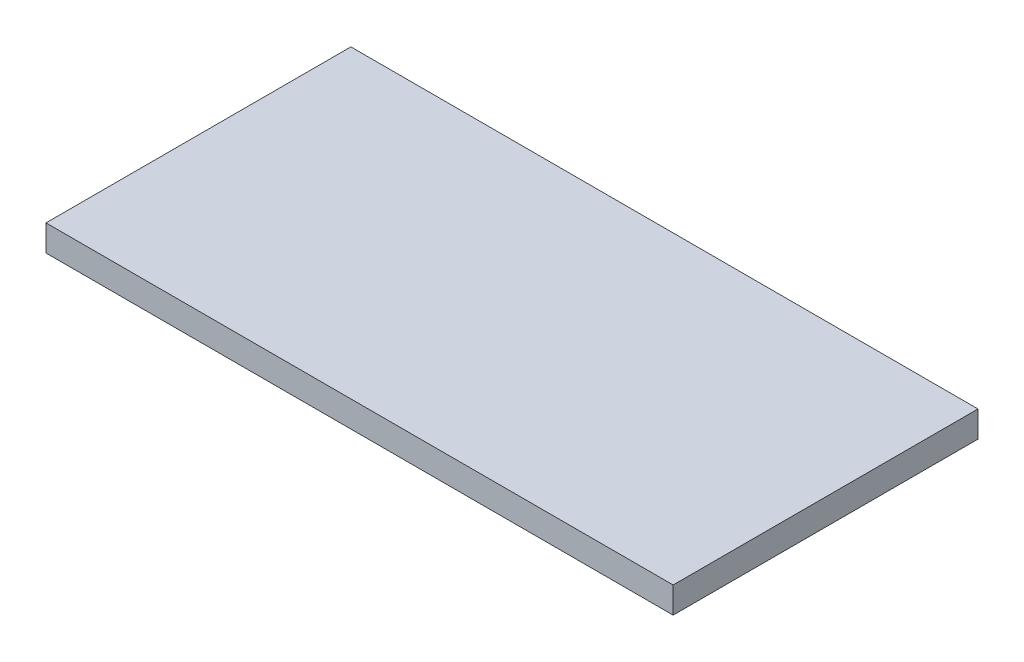
ISO-10303-21;
HEADER;
FILE_DESCRIPTION(('STEP AP214'),'2;1');
FILE_NAME('part.step','',(''),(''),'','','');
FILE_SCHEMA(('AUTOMOTIVE_DESIGN { 1 0 10303 214 1 1 1 1 }'));
ENDSEC;
DATA;
#1=APPLICATION_CONTEXT('core data for automotive mechanical design processes');
#2=APPLICATION_PROTOCOL_DEFINITION('international standard','automotive_design',2000,#1);
#3=PRODUCT_CONTEXT('',#1,'mechanical');
#4=PRODUCT('Part','Part','',(#3));
#5=PRODUCT_RELATED_PRODUCT_CATEGORY('part','',(#4));
#6=PRODUCT_DEFINITION_FORMATION('','',#4);
#7=PRODUCT_DEFINITION_CONTEXT('part definition',#1,'design');
#8=PRODUCT_DEFINITION('design','',#6,#7);
#9=PRODUCT_DEFINITION_SHAPE('','',#8);
#10=(LENGTH_UNIT() NAMED_UNIT(*) SI_UNIT(.MILLI.,.METRE.));
#11=(NAMED_UNIT(*) PLANE_ANGLE_UNIT() SI_UNIT($,.RADIAN.));
#12=(NAMED_UNIT(*) SI_UNIT($,.STERADIAN.) SOLID_ANGLE_UNIT());
#13=UNCERTAINTY_MEASURE_WITH_UNIT(LENGTH_MEASURE(1.E-05),#10,'distance_accuracy_value','');
#14=(GEOMETRIC_REPRESENTATION_CONTEXT(3) GLOBAL_UNCERTAINTY_ASSIGNED_CONTEXT((#13)) GLOBAL_UNIT_ASSIGNED_CONTEXT((#10,
#11,#12)) REPRESENTATION_CONTEXT('',''));
#15=CARTESIAN_POINT('',(0.,0.,0.));
#16=DIRECTION('',(0.,0.,1.));
#17=DIRECTION('',(1.,0.,0.));
#18=AXIS2_PLACEMENT_3D('',#15,#16,#17);
#19=CARTESIAN_POINT('',(0.,30.,0.));
#20=DIRECTION('',(1.,0.,0.));
#21=DIRECTION('',(0.,0.,-1.));
#22=AXIS2_PLACEMENT_3D('',#19,#20,#21);
#23=PLANE('',#22);
#24=DIRECTION('',(0.,0.,1.));
#25=VECTOR('',#24,1.);
#26=CARTESIAN_POINT('',(0.,0.,0.));
#27=LINE('',#26,#25);
#28=CARTESIAN_POINT('',(0.,0.,-350.));
#29=VERTEX_POINT('',#28);
#30=CARTESIAN_POINT('',(0.,0.,0.));
#31=VERTEX_POINT('',#30);
#32=EDGE_CURVE('E94',#29,#31,#27,.T.);
#33=ORIENTED_EDGE('',*,*,#32,.T.);
#34=DIRECTION('',(0.,-1.,0.));
#35=VECTOR('',#34,1.);
#36=CARTESIAN_POINT('',(0.,30.,0.));
#37=LINE('',#36,#35);
#38=CARTESIAN_POINT('',(0.,30.,0.));
#39=VERTEX_POINT('',#38);
#40=EDGE_CURVE('E11',#39,#31,#37,.T.);
#41=ORIENTED_EDGE('',*,*,#40,.F.);
#42=DIRECTION('',(0.,0.,1.));
#43=VECTOR('',#42,1.);
#44=CARTESIAN_POINT('',(0.,30.,0.));
#45=LINE('',#44,#43);
#46=CARTESIAN_POINT('',(0.,30.,-350.));
#47=VERTEX_POINT('',#46);
#48=EDGE_CURVE('E82',#47,#39,#45,.T.);
#49=ORIENTED_EDGE('',*,*,#48,.F.);
#50=DIRECTION('',(0.,-1.,0.));
#51=VECTOR('',#50,1.);
#52=CARTESIAN_POINT('',(0.,30.,-350.));
#53=LINE('',#52,#51);
#54=EDGE_CURVE('E90',#47,#29,#53,.T.);
#55=ORIENTED_EDGE('',*,*,#54,.T.);
#56=EDGE_LOOP('',(#33,#41,#49,#55));
#57=FACE_BOUND('',#56,.T.);
#58=ADVANCED_FACE('F31',(#57),#23,.F.);
#59=CARTESIAN_POINT('',(0.,30.,0.));
#60=DIRECTION('',(0.,0.,-1.));
#61=DIRECTION('',(-1.,0.,0.));
#62=AXIS2_PLACEMENT_3D('',#59,#60,#61);
#63=PLANE('',#62);
#64=DIRECTION('',(1.,0.,0.));
#65=VECTOR('',#64,1.);
#66=CARTESIAN_POINT('',(0.,0.,0.));
#67=LINE('',#66,#65);
#68=CARTESIAN_POINT('',(720.,0.,0.));
#69=VERTEX_POINT('',#68);
#70=EDGE_CURVE('E86',#31,#69,#67,.T.);
#71=ORIENTED_EDGE('',*,*,#70,.T.);
#72=DIRECTION('',(0.,-1.,0.));
#73=VECTOR('',#72,1.);
#74=CARTESIAN_POINT('',(720.,30.,0.));
#75=LINE('',#74,#73);
#76=CARTESIAN_POINT('',(720.,30.,0.));
#77=VERTEX_POINT('',#76);
#78=EDGE_CURVE('E39',#77,#69,#75,.T.);
#79=ORIENTED_EDGE('',*,*,#78,.F.);
#80=DIRECTION('',(1.,0.,0.));
#81=VECTOR('',#80,1.);
#82=CARTESIAN_POINT('',(0.,30.,0.));
#83=LINE('',#82,#81);
#84=EDGE_CURVE('E77',#39,#77,#83,.T.);
#85=ORIENTED_EDGE('',*,*,#84,.F.);
#86=ORIENTED_EDGE('',*,*,#40,.T.);
#87=EDGE_LOOP('',(#71,#79,#85,#86));
#88=FACE_BOUND('',#87,.T.);
#89=ADVANCED_FACE('F85',(#88),#63,.F.);
#90=CARTESIAN_POINT('',(720.,30.,0.));
#91=DIRECTION('',(-1.,0.,0.));
#92=DIRECTION('',(0.,0.,1.));
#93=AXIS2_PLACEMENT_3D('',#90,#91,#92);
#94=PLANE('',#93);
#95=DIRECTION('',(0.,0.,-1.));
#96=VECTOR('',#95,1.);
#97=CARTESIAN_POINT('',(720.,0.,0.));
#98=LINE('',#97,#96);
#99=CARTESIAN_POINT('',(720.,0.,-350.));
#100=VERTEX_POINT('',#99);
#101=EDGE_CURVE('E64',#69,#100,#98,.T.);
#102=ORIENTED_EDGE('',*,*,#101,.T.);
#103=DIRECTION('',(0.,-1.,0.));
#104=VECTOR('',#103,1.);
#105=CARTESIAN_POINT('',(720.,30.,-350.));
#106=LINE('',#105,#104);
#107=CARTESIAN_POINT('',(720.,30.,-350.));
#108=VERTEX_POINT('',#107);
#109=EDGE_CURVE('E87',#108,#100,#106,.T.);
#110=ORIENTED_EDGE('',*,*,#109,.F.);
#111=DIRECTION('',(0.,0.,-1.));
#112=VECTOR('',#111,1.);
#113=CARTESIAN_POINT('',(720.,30.,0.));
#114=LINE('',#113,#112);
#115=EDGE_CURVE('E80',#77,#108,#114,.T.);
#116=ORIENTED_EDGE('',*,*,#115,.F.);
#117=ORIENTED_EDGE('',*,*,#78,.T.);
#118=EDGE_LOOP('',(#102,#110,#116,#117));
#119=FACE_BOUND('',#118,.T.);
#120=ADVANCED_FACE('F88',(#119),#94,.F.);
#121=CARTESIAN_POINT('',(0.,30.,-350.));
#122=DIRECTION('',(0.,0.,1.));
#123=DIRECTION('',(1.,0.,0.));
#124=AXIS2_PLACEMENT_3D('',#121,#122,#123);
#125=PLANE('',#124);
#126=DIRECTION('',(-1.,0.,0.));
#127=VECTOR('',#126,1.);
#128=CARTESIAN_POINT('',(0.,0.,-350.));
#129=LINE('',#128,#127);
#130=EDGE_CURVE('E70',#100,#29,#129,.T.);
#131=ORIENTED_EDGE('',*,*,#130,.T.);
#132=ORIENTED_EDGE('',*,*,#54,.F.);
#133=DIRECTION('',(-1.,0.,0.));
#134=VECTOR('',#133,1.);
#135=CARTESIAN_POINT('',(0.,30.,-350.));
#136=LINE('',#135,#134);
#137=EDGE_CURVE('E47',#108,#47,#136,.T.);
#138=ORIENTED_EDGE('',*,*,#137,.F.);
#139=ORIENTED_EDGE('',*,*,#109,.T.);
#140=EDGE_LOOP('',(#131,#132,#138,#139));
#141=FACE_BOUND('',#140,.T.);
#142=ADVANCED_FACE('F101',(#141),#125,.F.);
#143=CARTESIAN_POINT('',(0.,30.,0.));
#144=DIRECTION('',(0.,-1.,0.));
#145=DIRECTION('',(0.,0.,-1.));
#146=AXIS2_PLACEMENT_3D('',#143,#144,#145);
#147=PLANE('',#146);
#148=ORIENTED_EDGE('',*,*,#48,.T.);
#149=ORIENTED_EDGE('',*,*,#84,.T.);
#150=ORIENTED_EDGE('',*,*,#115,.T.);
#151=ORIENTED_EDGE('',*,*,#137,.T.);
#152=EDGE_LOOP('',(#148,#149,#150,#151));
#153=FACE_BOUND('',#152,.T.);
#154=ADVANCED_FACE('F78',(#153),#147,.F.);
#155=CARTESIAN_POINT('',(0.,0.,0.));
#156=DIRECTION('',(0.,-1.,0.));
#157=DIRECTION('',(0.,0.,-1.));
#158=AXIS2_PLACEMENT_3D('',#155,#156,#157);
#159=PLANE('',#158);
#160=ORIENTED_EDGE('',*,*,#32,.F.);
#161=ORIENTED_EDGE('',*,*,#130,.F.);
#162=ORIENTED_EDGE('',*,*,#101,.F.);
#163=ORIENTED_EDGE('',*,*,#70,.F.);
#164=EDGE_LOOP('',(#160,#161,#162,#163));
#165=FACE_BOUND('',#164,.T.);
#166=ADVANCED_FACE('F104',(#165),#159,.T.);
#167=CLOSED_SHELL('',(#58,#89,#120,#142,#154,#166));
#168=MANIFOLD_SOLID_BREP('B2',#167);
#169=ADVANCED_BREP_SHAPE_REPRESENTATION('',(#18,#168),#14);
#170=SHAPE_DEFINITION_REPRESENTATION(#9,#169);
ENDSEC;
END-ISO-10303-21;
